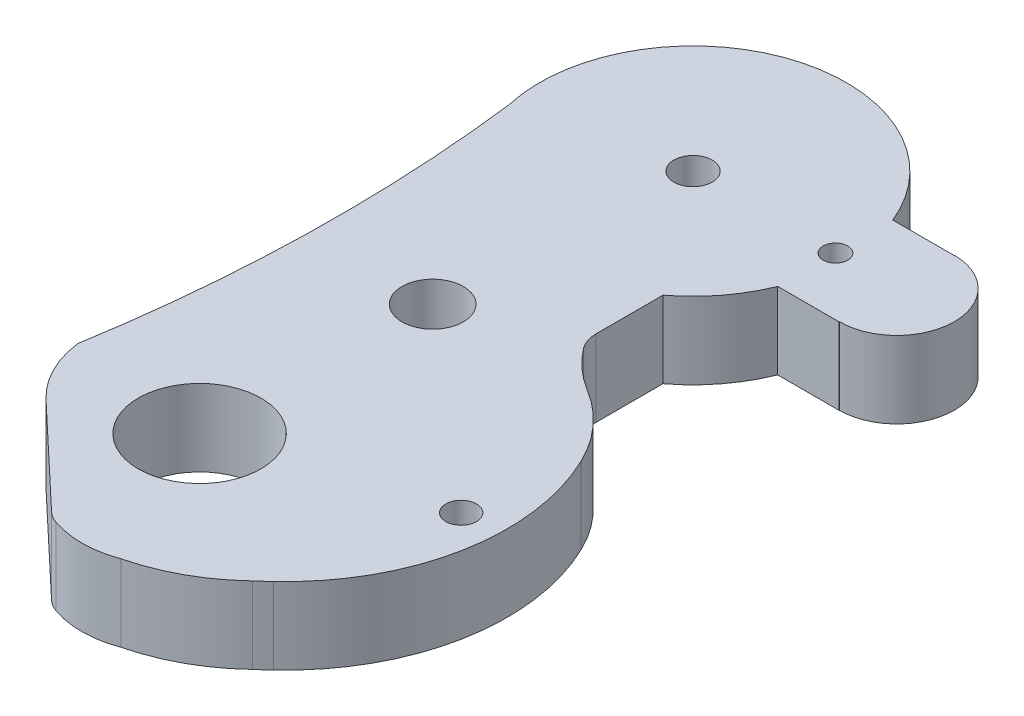
ISO-10303-21;
HEADER;
FILE_DESCRIPTION(('STEP AP214'),'2;1');
FILE_NAME('part.step','',(''),(''),'','','');
FILE_SCHEMA(('AUTOMOTIVE_DESIGN { 1 0 10303 214 1 1 1 1 }'));
ENDSEC;
DATA;
#1=APPLICATION_CONTEXT('core data for automotive mechanical design processes');
#2=APPLICATION_PROTOCOL_DEFINITION('international standard','automotive_design',2000,#1);
#3=PRODUCT_CONTEXT('',#1,'mechanical');
#4=PRODUCT('Part','Part','',(#3));
#5=PRODUCT_RELATED_PRODUCT_CATEGORY('part','',(#4));
#6=PRODUCT_DEFINITION_FORMATION('','',#4);
#7=PRODUCT_DEFINITION_CONTEXT('part definition',#1,'design');
#8=PRODUCT_DEFINITION('design','',#6,#7);
#9=PRODUCT_DEFINITION_SHAPE('','',#8);
#10=(LENGTH_UNIT() NAMED_UNIT(*) SI_UNIT(.MILLI.,.METRE.));
#11=(NAMED_UNIT(*) PLANE_ANGLE_UNIT() SI_UNIT($,.RADIAN.));
#12=(NAMED_UNIT(*) SI_UNIT($,.STERADIAN.) SOLID_ANGLE_UNIT());
#13=UNCERTAINTY_MEASURE_WITH_UNIT(LENGTH_MEASURE(1.E-05),#10,'distance_accuracy_value','');
#14=(GEOMETRIC_REPRESENTATION_CONTEXT(3) GLOBAL_UNCERTAINTY_ASSIGNED_CONTEXT((#13)) GLOBAL_UNIT_ASSIGNED_CONTEXT((#10,
#11,#12)) REPRESENTATION_CONTEXT('',''));
#15=CARTESIAN_POINT('',(0.,0.,0.));
#16=DIRECTION('',(0.,0.,1.));
#17=DIRECTION('',(1.,0.,0.));
#18=AXIS2_PLACEMENT_3D('',#15,#16,#17);
#19=CARTESIAN_POINT('',(0.974607404962177,5.,-16.));
#20=DIRECTION('',(0.,1.,0.));
#21=DIRECTION('',(0.,0.,1.));
#22=AXIS2_PLACEMENT_3D('',#19,#20,#21);
#23=PLANE('',#22);
#24=CARTESIAN_POINT('',(10.2454478315697,5.,-16.015232537957));
#25=DIRECTION('',(0.,1.,0.));
#26=DIRECTION('',(0.,0.,1.));
#27=AXIS2_PLACEMENT_3D('',#24,#25,#26);
#28=CIRCLE('',#27,0.801632386652614);
#29=CARTESIAN_POINT('',(10.2454478315697,5.,-15.2136001513043));
#30=VERTEX_POINT('',#29);
#31=EDGE_CURVE('E409',#30,#30,#28,.T.);
#32=ORIENTED_EDGE('',*,*,#31,.F.);
#33=EDGE_LOOP('',(#32));
#34=FACE_BOUND('',#33,.T.);
#35=CARTESIAN_POINT('',(0.974607404962177,5.,-16.));
#36=DIRECTION('',(0.,1.,0.));
#37=DIRECTION('',(0.,0.,1.));
#38=AXIS2_PLACEMENT_3D('',#35,#36,#37);
#39=CIRCLE('',#38,1.25);
#40=CARTESIAN_POINT('',(0.974607404962177,5.,-14.75));
#41=VERTEX_POINT('',#40);
#42=EDGE_CURVE('E393',#41,#41,#39,.T.);
#43=ORIENTED_EDGE('',*,*,#42,.F.);
#44=EDGE_LOOP('',(#43));
#45=FACE_BOUND('',#44,.T.);
#46=DIRECTION('',(0.727058949625669,0.,0.686575038702413));
#47=VECTOR('',#46,1.);
#48=CARTESIAN_POINT('',(-7.21726233960275,5.,17.9902605030518));
#49=LINE('',#48,#47);
#50=CARTESIAN_POINT('',(-7.21726233960275,5.,17.9902605030518));
#51=VERTEX_POINT('',#50);
#52=CARTESIAN_POINT('',(-0.695462039847712,5.,24.1489155825596));
#53=VERTEX_POINT('',#52);
#54=EDGE_CURVE('E338',#51,#53,#49,.T.);
#55=ORIENTED_EDGE('',*,*,#54,.T.);
#56=CARTESIAN_POINT('',(0.677688037557113,5.,22.6947976833082));
#57=DIRECTION('',(0.,1.,0.));
#58=DIRECTION('',(0.,0.,1.));
#59=AXIS2_PLACEMENT_3D('',#56,#57,#58);
#60=CIRCLE('',#59,2.);
#61=CARTESIAN_POINT('',(0.0198009511940371,5.,24.5834968604131));
#62=VERTEX_POINT('',#61);
#63=EDGE_CURVE('E11',#53,#62,#60,.T.);
#64=ORIENTED_EDGE('',*,*,#63,.T.);
#65=CARTESIAN_POINT('',(2.04817996234208,5.,18.7603125349833));
#66=DIRECTION('',(0.,1.,0.));
#67=DIRECTION('',(0.,0.,1.));
#68=AXIS2_PLACEMENT_3D('',#65,#66,#67);
#69=CIRCLE('',#68,6.16634390062681);
#70=CARTESIAN_POINT('',(4.21713136680598,5.,24.5326125017099));
#71=VERTEX_POINT('',#70);
#72=EDGE_CURVE('E248',#62,#71,#69,.T.);
#73=ORIENTED_EDGE('',*,*,#72,.T.);
#74=CARTESIAN_POINT('',(1.28281003382921,5.,12.6259004719606));
#75=DIRECTION('',(0.,1.,0.));
#76=DIRECTION('',(0.,0.,-1.));
#77=AXIS2_PLACEMENT_3D('',#74,#75,#76);
#78=CIRCLE('',#77,12.2629536835356);
#79=CARTESIAN_POINT('',(9.75886106909215,5.,21.4879878046468));
#80=VERTEX_POINT('',#79);
#81=EDGE_CURVE('E380',#71,#80,#78,.T.);
#82=ORIENTED_EDGE('',*,*,#81,.T.);
#83=CARTESIAN_POINT('',(1.43522280426066,5.,11.6928102282221));
#84=DIRECTION('',(0.,1.,0.));
#85=DIRECTION('',(0.,0.,-1.));
#86=AXIS2_PLACEMENT_3D('',#83,#84,#85);
#87=CIRCLE('',#86,12.8541222071933);
#88=CARTESIAN_POINT('',(10.471403603469,5.,20.8347954765956));
#89=VERTEX_POINT('',#88);
#90=EDGE_CURVE('E377',#80,#89,#87,.T.);
#91=ORIENTED_EDGE('',*,*,#90,.T.);
#92=CARTESIAN_POINT('',(0.731361604442221,5.,10.2463105660363));
#93=DIRECTION('',(0.,1.,0.));
#94=DIRECTION('',(0.,0.,-1.));
#95=AXIS2_PLACEMENT_3D('',#92,#93,#94);
#96=CIRCLE('',#95,14.3869534941886);
#97=CARTESIAN_POINT('',(13.6971581945239,5.,4.01152511434899));
#98=VERTEX_POINT('',#97);
#99=EDGE_CURVE('E373',#89,#98,#96,.T.);
#100=ORIENTED_EDGE('',*,*,#99,.T.);
#101=CARTESIAN_POINT('',(4.68496767391163,5.,8.34516354183524));
#102=DIRECTION('',(0.,1.,0.));
#103=DIRECTION('',(0.,0.,1.));
#104=AXIS2_PLACEMENT_3D('',#101,#102,#103);
#105=CIRCLE('',#104,10.);
#106=CARTESIAN_POINT('',(9.87941642371002,5.,-0.199876082749191));
#107=VERTEX_POINT('',#106);
#108=EDGE_CURVE('E219',#98,#107,#105,.T.);
#109=ORIENTED_EDGE('',*,*,#108,.T.);
#110=CARTESIAN_POINT('',(14.4947138463816,5.,-7.79219266061537));
#111=DIRECTION('',(0.,-1.,0.));
#112=DIRECTION('',(0.,0.,1.));
#113=AXIS2_PLACEMENT_3D('',#110,#111,#112);
#114=CIRCLE('',#113,8.88505719273996);
#115=CARTESIAN_POINT('',(7.40438640935661,5.,-2.43761535199134));
#116=VERTEX_POINT('',#115);
#117=EDGE_CURVE('E369',#107,#116,#114,.T.);
#118=ORIENTED_EDGE('',*,*,#117,.T.);
#119=CARTESIAN_POINT('',(9.00039806875673,5.,-3.64291480982698));
#120=DIRECTION('',(0.,1.,0.));
#121=DIRECTION('',(0.,0.,1.));
#122=AXIS2_PLACEMENT_3D('',#119,#120,#121);
#123=CIRCLE('',#122,2.);
#124=CARTESIAN_POINT('',(7.00039806875673,5.,-3.64291480982698));
#125=VERTEX_POINT('',#124);
#126=EDGE_CURVE('E232',#116,#125,#123,.F.);
#127=ORIENTED_EDGE('',*,*,#126,.T.);
#128=DIRECTION('',(0.,0.,-1.));
#129=VECTOR('',#128,1.);
#130=CARTESIAN_POINT('',(7.00039806875673,5.,-8.01940811241883));
#131=LINE('',#130,#129);
#132=CARTESIAN_POINT('',(7.00039806875673,5.,-8.01940811241883));
#133=VERTEX_POINT('',#132);
#134=EDGE_CURVE('E366',#125,#133,#131,.T.);
#135=ORIENTED_EDGE('',*,*,#134,.T.);
#136=CARTESIAN_POINT('',(0.974607404962177,5.,-16.));
#137=DIRECTION('',(0.,1.,0.));
#138=DIRECTION('',(0.,0.,1.));
#139=AXIS2_PLACEMENT_3D('',#136,#137,#138);
#140=CIRCLE('',#139,10.);
#141=CARTESIAN_POINT('',(10.2454478315697,5.,-12.2514645814158));
#142=VERTEX_POINT('',#141);
#143=EDGE_CURVE('E363',#133,#142,#140,.T.);
#144=ORIENTED_EDGE('',*,*,#143,.T.);
#145=DIRECTION('',(1.,0.,0.));
#146=VECTOR('',#145,1.);
#147=CARTESIAN_POINT('',(10.2454478315697,5.,-12.2514645814158));
#148=LINE('',#147,#146);
#149=CARTESIAN_POINT('',(14.2454478315697,5.,-12.2514645814158));
#150=VERTEX_POINT('',#149);
#151=EDGE_CURVE('E360',#142,#150,#148,.T.);
#152=ORIENTED_EDGE('',*,*,#151,.T.);
#153=DIRECTION('',(0.,0.,-1.));
#154=VECTOR('',#153,1.);
#155=CARTESIAN_POINT('',(14.2454478315697,5.,-12.2514645814158));
#156=LINE('',#155,#154);
#157=CARTESIAN_POINT('',(14.2454478315697,5.,-12.265232537957));
#158=VERTEX_POINT('',#157);
#159=EDGE_CURVE('E357',#150,#158,#156,.T.);
#160=ORIENTED_EDGE('',*,*,#159,.T.);
#161=CARTESIAN_POINT('',(14.2454478315697,5.,-16.015232537957));
#162=DIRECTION('',(0.,1.,0.));
#163=DIRECTION('',(0.,0.,1.));
#164=AXIS2_PLACEMENT_3D('',#161,#162,#163);
#165=CIRCLE('',#164,3.75);
#166=CARTESIAN_POINT('',(14.2454478315697,5.,-19.765232537957));
#167=VERTEX_POINT('',#166);
#168=EDGE_CURVE('E354',#158,#167,#165,.T.);
#169=ORIENTED_EDGE('',*,*,#168,.T.);
#170=DIRECTION('',(-1.03893578122433E-13,0.,1.));
#171=VECTOR('',#170,1.);
#172=CARTESIAN_POINT('',(14.2454478315697,5.,-19.765232537957));
#173=LINE('',#172,#171);
#174=CARTESIAN_POINT('',(14.2454478315697,5.,-19.7485354185842));
#175=VERTEX_POINT('',#174);
#176=EDGE_CURVE('E351',#167,#175,#173,.T.);
#177=ORIENTED_EDGE('',*,*,#176,.T.);
#178=DIRECTION('',(-1.,0.,0.));
#179=VECTOR('',#178,1.);
#180=CARTESIAN_POINT('',(10.2454478315697,5.,-19.7485354185842));
#181=LINE('',#180,#179);
#182=CARTESIAN_POINT('',(10.2454478315697,5.,-19.7485354185842));
#183=VERTEX_POINT('',#182);
#184=EDGE_CURVE('E192',#175,#183,#181,.T.);
#185=ORIENTED_EDGE('',*,*,#184,.T.);
#186=CARTESIAN_POINT('',(0.974607404962177,5.,-16.));
#187=DIRECTION('',(0.,1.,0.));
#188=DIRECTION('',(0.,0.,1.));
#189=AXIS2_PLACEMENT_3D('',#186,#187,#188);
#190=CIRCLE('',#189,10.);
#191=CARTESIAN_POINT('',(-8.77146664465953,5.,-13.7607946455739));
#192=VERTEX_POINT('',#191);
#193=EDGE_CURVE('E187',#183,#192,#190,.T.);
#194=ORIENTED_EDGE('',*,*,#193,.T.);
#195=CARTESIAN_POINT('',(-104.432630634702,5.,-1.96176281245479));
#196=DIRECTION('',(0.,-1.,0.));
#197=DIRECTION('',(0.,0.,-1.));
#198=AXIS2_PLACEMENT_3D('',#195,#196,#197);
#199=CIRCLE('',#198,96.3860749700326);
#200=CARTESIAN_POINT('',(-9.34331307153592,5.,13.79568410956));
#201=VERTEX_POINT('',#200);
#202=EDGE_CURVE('E175',#192,#201,#199,.T.);
#203=ORIENTED_EDGE('',*,*,#202,.T.);
#204=CARTESIAN_POINT('',(-2.44267041005947,5.,12.9341346646501));
#205=DIRECTION('',(0.,1.,0.));
#206=DIRECTION('',(0.,0.,1.));
#207=AXIS2_PLACEMENT_3D('',#204,#205,#206);
#208=CIRCLE('',#207,6.95421718005797);
#209=EDGE_CURVE('E186',#201,#51,#208,.T.);
#210=ORIENTED_EDGE('',*,*,#209,.T.);
#211=EDGE_LOOP('',(#55,#64,#73,#82,#91,#100,#109,#118,#127,#135,#144,#152,#160,#169,#177,#185,
#194,#203,#210));
#212=FACE_BOUND('',#211,.T.);
#213=CARTESIAN_POINT('',(0.,5.,0.));
#214=DIRECTION('',(0.,1.,0.));
#215=DIRECTION('',(0.,0.,1.));
#216=AXIS2_PLACEMENT_3D('',#213,#214,#215);
#217=CIRCLE('',#216,2.);
#218=CARTESIAN_POINT('',(0.,5.,2.));
#219=VERTEX_POINT('',#218);
#220=EDGE_CURVE('E348',#219,#219,#217,.T.);
#221=ORIENTED_EDGE('',*,*,#220,.F.);
#222=EDGE_LOOP('',(#221));
#223=FACE_BOUND('',#222,.T.);
#224=CARTESIAN_POINT('',(-0.296635988770262,5.,14.8977042577984));
#225=DIRECTION('',(0.,1.,0.));
#226=DIRECTION('',(0.,0.,1.));
#227=AXIS2_PLACEMENT_3D('',#224,#225,#226);
#228=CIRCLE('',#227,4.);
#229=CARTESIAN_POINT('',(-0.296635988770262,5.,18.8977042577984));
#230=VERTEX_POINT('',#229);
#231=EDGE_CURVE('E401',#230,#230,#228,.T.);
#232=ORIENTED_EDGE('',*,*,#231,.F.);
#233=EDGE_LOOP('',(#232));
#234=FACE_BOUND('',#233,.T.);
#235=CARTESIAN_POINT('',(12.7069755294834,5.,10.8462503022307));
#236=DIRECTION('',(0.,1.,0.));
#237=DIRECTION('',(0.,0.,1.));
#238=AXIS2_PLACEMENT_3D('',#235,#236,#237);
#239=CIRCLE('',#238,1.);
#240=CARTESIAN_POINT('',(12.7069755294834,5.,11.8462503022307));
#241=VERTEX_POINT('',#240);
#242=EDGE_CURVE('E417',#241,#241,#239,.T.);
#243=ORIENTED_EDGE('',*,*,#242,.F.);
#244=EDGE_LOOP('',(#243));
#245=FACE_BOUND('',#244,.T.);
#246=ADVANCED_FACE('F43',(#34,#45,#212,#223,#234,#245),#23,.T.);
#247=CARTESIAN_POINT('',(0.974607404962177,0.,-16.));
#248=DIRECTION('',(0.,1.,0.));
#249=DIRECTION('',(0.,0.,1.));
#250=AXIS2_PLACEMENT_3D('',#247,#248,#249);
#251=PLANE('',#250);
#252=CARTESIAN_POINT('',(2.04817996234208,0.,18.7603125349833));
#253=DIRECTION('',(0.,1.,0.));
#254=DIRECTION('',(0.,0.,1.));
#255=AXIS2_PLACEMENT_3D('',#252,#253,#254);
#256=CIRCLE('',#255,6.16634390062681);
#257=CARTESIAN_POINT('',(0.0198009511940371,0.,24.5834968604131));
#258=VERTEX_POINT('',#257);
#259=CARTESIAN_POINT('',(4.21713136680598,0.,24.5326125017099));
#260=VERTEX_POINT('',#259);
#261=EDGE_CURVE('E246',#258,#260,#256,.T.);
#262=ORIENTED_EDGE('',*,*,#261,.F.);
#263=CARTESIAN_POINT('',(0.677688037557113,0.,22.6947976833082));
#264=DIRECTION('',(0.,1.,0.));
#265=DIRECTION('',(0.,0.,1.));
#266=AXIS2_PLACEMENT_3D('',#263,#264,#265);
#267=CIRCLE('',#266,2.);
#268=CARTESIAN_POINT('',(-0.695462039847712,0.,24.1489155825596));
#269=VERTEX_POINT('',#268);
#270=EDGE_CURVE('E66',#258,#269,#267,.F.);
#271=ORIENTED_EDGE('',*,*,#270,.T.);
#272=DIRECTION('',(0.727058949625669,0.,0.686575038702413));
#273=VECTOR('',#272,1.);
#274=CARTESIAN_POINT('',(-7.21726233960275,0.,17.9902605030518));
#275=LINE('',#274,#273);
#276=CARTESIAN_POINT('',(-7.21726233960275,0.,17.9902605030518));
#277=VERTEX_POINT('',#276);
#278=EDGE_CURVE('E257',#277,#269,#275,.T.);
#279=ORIENTED_EDGE('',*,*,#278,.F.);
#280=CARTESIAN_POINT('',(-2.44267041005947,0.,12.9341346646501));
#281=DIRECTION('',(0.,1.,0.));
#282=DIRECTION('',(0.,0.,1.));
#283=AXIS2_PLACEMENT_3D('',#280,#281,#282);
#284=CIRCLE('',#283,6.95421718005797);
#285=CARTESIAN_POINT('',(-9.34331307153592,0.,13.79568410956));
#286=VERTEX_POINT('',#285);
#287=EDGE_CURVE('E263',#286,#277,#284,.T.);
#288=ORIENTED_EDGE('',*,*,#287,.F.);
#289=CARTESIAN_POINT('',(-104.432630634702,0.,-1.96176281245479));
#290=DIRECTION('',(0.,-1.,0.));
#291=DIRECTION('',(0.,0.,-1.));
#292=AXIS2_PLACEMENT_3D('',#289,#290,#291);
#293=CIRCLE('',#292,96.3860749700326);
#294=CARTESIAN_POINT('',(-8.77146664465953,0.,-13.7607946455739));
#295=VERTEX_POINT('',#294);
#296=EDGE_CURVE('E341',#295,#286,#293,.T.);
#297=ORIENTED_EDGE('',*,*,#296,.F.);
#298=CARTESIAN_POINT('',(0.974607404962177,0.,-16.));
#299=DIRECTION('',(0.,1.,0.));
#300=DIRECTION('',(0.,0.,1.));
#301=AXIS2_PLACEMENT_3D('',#298,#299,#300);
#302=CIRCLE('',#301,10.);
#303=CARTESIAN_POINT('',(10.2454478315697,0.,-19.7485354185842));
#304=VERTEX_POINT('',#303);
#305=EDGE_CURVE('E201',#304,#295,#302,.T.);
#306=ORIENTED_EDGE('',*,*,#305,.F.);
#307=DIRECTION('',(-1.,0.,0.));
#308=VECTOR('',#307,1.);
#309=CARTESIAN_POINT('',(10.2454478315697,0.,-19.7485354185842));
#310=LINE('',#309,#308);
#311=CARTESIAN_POINT('',(14.2454478315697,0.,-19.7485354185842));
#312=VERTEX_POINT('',#311);
#313=EDGE_CURVE('E197',#312,#304,#310,.T.);
#314=ORIENTED_EDGE('',*,*,#313,.F.);
#315=DIRECTION('',(-1.03893578122433E-13,0.,1.));
#316=VECTOR('',#315,1.);
#317=CARTESIAN_POINT('',(14.2454478315697,0.,-19.765232537957));
#318=LINE('',#317,#316);
#319=CARTESIAN_POINT('',(14.2454478315697,0.,-19.765232537957));
#320=VERTEX_POINT('',#319);
#321=EDGE_CURVE('E292',#320,#312,#318,.T.);
#322=ORIENTED_EDGE('',*,*,#321,.F.);
#323=CARTESIAN_POINT('',(14.2454478315697,0.,-16.015232537957));
#324=DIRECTION('',(0.,1.,0.));
#325=DIRECTION('',(0.,0.,1.));
#326=AXIS2_PLACEMENT_3D('',#323,#324,#325);
#327=CIRCLE('',#326,3.75);
#328=CARTESIAN_POINT('',(14.2454478315697,0.,-12.265232537957));
#329=VERTEX_POINT('',#328);
#330=EDGE_CURVE('E289',#329,#320,#327,.T.);
#331=ORIENTED_EDGE('',*,*,#330,.F.);
#332=DIRECTION('',(0.,0.,-1.));
#333=VECTOR('',#332,1.);
#334=CARTESIAN_POINT('',(14.2454478315697,0.,-12.2514645814158));
#335=LINE('',#334,#333);
#336=CARTESIAN_POINT('',(14.2454478315697,0.,-12.2514645814158));
#337=VERTEX_POINT('',#336);
#338=EDGE_CURVE('E286',#337,#329,#335,.T.);
#339=ORIENTED_EDGE('',*,*,#338,.F.);
#340=DIRECTION('',(1.,0.,0.));
#341=VECTOR('',#340,1.);
#342=CARTESIAN_POINT('',(10.2454478315697,0.,-12.2514645814158));
#343=LINE('',#342,#341);
#344=CARTESIAN_POINT('',(10.2454478315697,0.,-12.2514645814158));
#345=VERTEX_POINT('',#344);
#346=EDGE_CURVE('E283',#345,#337,#343,.T.);
#347=ORIENTED_EDGE('',*,*,#346,.F.);
#348=CARTESIAN_POINT('',(0.974607404962177,0.,-16.));
#349=DIRECTION('',(0.,1.,0.));
#350=DIRECTION('',(0.,0.,1.));
#351=AXIS2_PLACEMENT_3D('',#348,#349,#350);
#352=CIRCLE('',#351,10.);
#353=CARTESIAN_POINT('',(7.00039806875673,0.,-8.01940811241883));
#354=VERTEX_POINT('',#353);
#355=EDGE_CURVE('E280',#354,#345,#352,.T.);
#356=ORIENTED_EDGE('',*,*,#355,.F.);
#357=DIRECTION('',(0.,0.,-1.));
#358=VECTOR('',#357,1.);
#359=CARTESIAN_POINT('',(7.00039806875673,0.,-8.01940811241883));
#360=LINE('',#359,#358);
#361=CARTESIAN_POINT('',(7.00039806875673,0.,-3.64291480982698));
#362=VERTEX_POINT('',#361);
#363=EDGE_CURVE('E277',#362,#354,#360,.T.);
#364=ORIENTED_EDGE('',*,*,#363,.F.);
#365=CARTESIAN_POINT('',(9.00039806875673,0.,-3.64291480982698));
#366=DIRECTION('',(0.,1.,0.));
#367=DIRECTION('',(0.,0.,1.));
#368=AXIS2_PLACEMENT_3D('',#365,#366,#367);
#369=CIRCLE('',#368,2.);
#370=CARTESIAN_POINT('',(7.40438640935661,0.,-2.43761535199134));
#371=VERTEX_POINT('',#370);
#372=EDGE_CURVE('E229',#362,#371,#369,.T.);
#373=ORIENTED_EDGE('',*,*,#372,.T.);
#374=CARTESIAN_POINT('',(14.4947138463816,0.,-7.79219266061537));
#375=DIRECTION('',(0.,-1.,0.));
#376=DIRECTION('',(0.,0.,1.));
#377=AXIS2_PLACEMENT_3D('',#374,#375,#376);
#378=CIRCLE('',#377,8.88505719273996);
#379=CARTESIAN_POINT('',(9.87941642371002,0.,-0.199876082749191));
#380=VERTEX_POINT('',#379);
#381=EDGE_CURVE('E273',#380,#371,#378,.T.);
#382=ORIENTED_EDGE('',*,*,#381,.F.);
#383=CARTESIAN_POINT('',(4.68496767391163,0.,8.34516354183524));
#384=DIRECTION('',(0.,1.,0.));
#385=DIRECTION('',(0.,0.,1.));
#386=AXIS2_PLACEMENT_3D('',#383,#384,#385);
#387=CIRCLE('',#386,10.);
#388=CARTESIAN_POINT('',(13.6971581945239,0.,4.01152511434899));
#389=VERTEX_POINT('',#388);
#390=EDGE_CURVE('E208',#380,#389,#387,.F.);
#391=ORIENTED_EDGE('',*,*,#390,.T.);
#392=CARTESIAN_POINT('',(0.731361604442221,0.,10.2463105660363));
#393=DIRECTION('',(0.,1.,0.));
#394=DIRECTION('',(0.,0.,-1.));
#395=AXIS2_PLACEMENT_3D('',#392,#393,#394);
#396=CIRCLE('',#395,14.3869534941886);
#397=CARTESIAN_POINT('',(10.471403603469,0.,20.8347954765956));
#398=VERTEX_POINT('',#397);
#399=EDGE_CURVE('E269',#398,#389,#396,.T.);
#400=ORIENTED_EDGE('',*,*,#399,.F.);
#401=CARTESIAN_POINT('',(1.43522280426066,0.,11.6928102282221));
#402=DIRECTION('',(0.,1.,0.));
#403=DIRECTION('',(0.,0.,-1.));
#404=AXIS2_PLACEMENT_3D('',#401,#402,#403);
#405=CIRCLE('',#404,12.8541222071933);
#406=CARTESIAN_POINT('',(9.75886106909215,0.,21.4879878046468));
#407=VERTEX_POINT('',#406);
#408=EDGE_CURVE('E261',#407,#398,#405,.T.);
#409=ORIENTED_EDGE('',*,*,#408,.F.);
#410=CARTESIAN_POINT('',(1.28281003382921,0.,12.6259004719606));
#411=DIRECTION('',(0.,1.,0.));
#412=DIRECTION('',(0.,0.,-1.));
#413=AXIS2_PLACEMENT_3D('',#410,#411,#412);
#414=CIRCLE('',#413,12.2629536835356);
#415=EDGE_CURVE('E255',#260,#407,#414,.T.);
#416=ORIENTED_EDGE('',*,*,#415,.F.);
#417=EDGE_LOOP('',(#262,#271,#279,#288,#297,#306,#314,#322,#331,#339,#347,#356,#364,#373,#382,
#391,#400,#409,#416));
#418=FACE_BOUND('',#417,.T.);
#419=CARTESIAN_POINT('',(0.,0.,0.));
#420=DIRECTION('',(0.,1.,0.));
#421=DIRECTION('',(0.,0.,1.));
#422=AXIS2_PLACEMENT_3D('',#419,#420,#421);
#423=CIRCLE('',#422,2.);
#424=CARTESIAN_POINT('',(0.,0.,2.));
#425=VERTEX_POINT('',#424);
#426=EDGE_CURVE('E389',#425,#425,#423,.T.);
#427=ORIENTED_EDGE('',*,*,#426,.T.);
#428=EDGE_LOOP('',(#427));
#429=FACE_BOUND('',#428,.T.);
#430=CARTESIAN_POINT('',(0.974607404962177,0.,-16.));
#431=DIRECTION('',(0.,1.,0.));
#432=DIRECTION('',(0.,0.,1.));
#433=AXIS2_PLACEMENT_3D('',#430,#431,#432);
#434=CIRCLE('',#433,1.25);
#435=CARTESIAN_POINT('',(0.974607404962177,0.,-14.75));
#436=VERTEX_POINT('',#435);
#437=EDGE_CURVE('E397',#436,#436,#434,.T.);
#438=ORIENTED_EDGE('',*,*,#437,.T.);
#439=EDGE_LOOP('',(#438));
#440=FACE_BOUND('',#439,.T.);
#441=CARTESIAN_POINT('',(-0.296635988770262,0.,14.8977042577984));
#442=DIRECTION('',(0.,1.,0.));
#443=DIRECTION('',(0.,0.,1.));
#444=AXIS2_PLACEMENT_3D('',#441,#442,#443);
#445=CIRCLE('',#444,4.);
#446=CARTESIAN_POINT('',(-0.296635988770262,0.,18.8977042577984));
#447=VERTEX_POINT('',#446);
#448=EDGE_CURVE('E405',#447,#447,#445,.T.);
#449=ORIENTED_EDGE('',*,*,#448,.T.);
#450=EDGE_LOOP('',(#449));
#451=FACE_BOUND('',#450,.T.);
#452=CARTESIAN_POINT('',(10.2454478315697,0.,-16.015232537957));
#453=DIRECTION('',(0.,1.,0.));
#454=DIRECTION('',(0.,0.,1.));
#455=AXIS2_PLACEMENT_3D('',#452,#453,#454);
#456=CIRCLE('',#455,0.801632386652614);
#457=CARTESIAN_POINT('',(10.2454478315697,0.,-15.2136001513043));
#458=VERTEX_POINT('',#457);
#459=EDGE_CURVE('E413',#458,#458,#456,.T.);
#460=ORIENTED_EDGE('',*,*,#459,.T.);
#461=EDGE_LOOP('',(#460));
#462=FACE_BOUND('',#461,.T.);
#463=CARTESIAN_POINT('',(12.7069755294834,0.,10.8462503022307));
#464=DIRECTION('',(0.,1.,0.));
#465=DIRECTION('',(0.,0.,1.));
#466=AXIS2_PLACEMENT_3D('',#463,#464,#465);
#467=CIRCLE('',#466,1.);
#468=CARTESIAN_POINT('',(12.7069755294834,0.,11.8462503022307));
#469=VERTEX_POINT('',#468);
#470=EDGE_CURVE('E421',#469,#469,#467,.T.);
#471=ORIENTED_EDGE('',*,*,#470,.T.);
#472=EDGE_LOOP('',(#471));
#473=FACE_BOUND('',#472,.T.);
#474=ADVANCED_FACE('F252',(#418,#429,#440,#451,#462,#473),#251,.F.);
#475=CARTESIAN_POINT('',(0.974607404962177,5.,-16.));
#476=DIRECTION('',(0.,-1.,0.));
#477=DIRECTION('',(0.,0.,-1.));
#478=AXIS2_PLACEMENT_3D('',#475,#476,#477);
#479=CYLINDRICAL_SURFACE('',#478,10.);
#480=ORIENTED_EDGE('',*,*,#305,.T.);
#481=DIRECTION('',(0.,-1.,0.));
#482=VECTOR('',#481,1.);
#483=CARTESIAN_POINT('',(-8.77146664465953,5.,-13.7607946455739));
#484=LINE('',#483,#482);
#485=EDGE_CURVE('E179',#192,#295,#484,.T.);
#486=ORIENTED_EDGE('',*,*,#485,.F.);
#487=ORIENTED_EDGE('',*,*,#193,.F.);
#488=DIRECTION('',(0.,-1.,0.));
#489=VECTOR('',#488,1.);
#490=CARTESIAN_POINT('',(10.2454478315697,5.,-19.7485354185842));
#491=LINE('',#490,#489);
#492=EDGE_CURVE('E297',#183,#304,#491,.T.);
#493=ORIENTED_EDGE('',*,*,#492,.T.);
#494=EDGE_LOOP('',(#480,#486,#487,#493));
#495=FACE_BOUND('',#494,.T.);
#496=ADVANCED_FACE('F199',(#495),#479,.T.);
#497=CARTESIAN_POINT('',(-104.432630634702,5.,-1.96176281245479));
#498=DIRECTION('',(0.,-1.,0.));
#499=DIRECTION('',(0.,0.,-1.));
#500=AXIS2_PLACEMENT_3D('',#497,#498,#499);
#501=CYLINDRICAL_SURFACE('',#500,96.3860749700326);
#502=ORIENTED_EDGE('',*,*,#296,.T.);
#503=DIRECTION('',(0.,-1.,0.));
#504=VECTOR('',#503,1.);
#505=CARTESIAN_POINT('',(-9.34331307153592,5.,13.79568410956));
#506=LINE('',#505,#504);
#507=EDGE_CURVE('E182',#201,#286,#506,.T.);
#508=ORIENTED_EDGE('',*,*,#507,.F.);
#509=ORIENTED_EDGE('',*,*,#202,.F.);
#510=ORIENTED_EDGE('',*,*,#485,.T.);
#511=EDGE_LOOP('',(#502,#508,#509,#510));
#512=FACE_BOUND('',#511,.T.);
#513=ADVANCED_FACE('F177',(#512),#501,.F.);
#514=CARTESIAN_POINT('',(-2.44267041005947,5.,12.9341346646501));
#515=DIRECTION('',(0.,-1.,0.));
#516=DIRECTION('',(0.,0.,-1.));
#517=AXIS2_PLACEMENT_3D('',#514,#515,#516);
#518=CYLINDRICAL_SURFACE('',#517,6.95421718005797);
#519=ORIENTED_EDGE('',*,*,#287,.T.);
#520=DIRECTION('',(0.,-1.,0.));
#521=VECTOR('',#520,1.);
#522=CARTESIAN_POINT('',(-7.21726233960275,5.,17.9902605030518));
#523=LINE('',#522,#521);
#524=EDGE_CURVE('E210',#51,#277,#523,.T.);
#525=ORIENTED_EDGE('',*,*,#524,.F.);
#526=ORIENTED_EDGE('',*,*,#209,.F.);
#527=ORIENTED_EDGE('',*,*,#507,.T.);
#528=EDGE_LOOP('',(#519,#525,#526,#527));
#529=FACE_BOUND('',#528,.T.);
#530=ADVANCED_FACE('F493',(#529),#518,.T.);
#531=CARTESIAN_POINT('',(-7.21726233960275,5.,17.9902605030518));
#532=DIRECTION('',(0.686575038702413,0.,-0.727058949625669));
#533=DIRECTION('',(-0.727058949625669,0.,-0.686575038702413));
#534=AXIS2_PLACEMENT_3D('',#531,#532,#533);
#535=PLANE('',#534);
#536=ORIENTED_EDGE('',*,*,#278,.T.);
#537=DIRECTION('',(0.,-1.,0.));
#538=VECTOR('',#537,1.);
#539=CARTESIAN_POINT('',(-0.695462039847712,5.,24.1489155825596));
#540=LINE('',#539,#538);
#541=EDGE_CURVE('E52',#269,#53,#540,.F.);
#542=ORIENTED_EDGE('',*,*,#541,.T.);
#543=ORIENTED_EDGE('',*,*,#54,.F.);
#544=ORIENTED_EDGE('',*,*,#524,.T.);
#545=EDGE_LOOP('',(#536,#542,#543,#544));
#546=FACE_BOUND('',#545,.T.);
#547=ADVANCED_FACE('F337',(#546),#535,.F.);
#548=CARTESIAN_POINT('',(2.04817996234208,5.,18.7603125349833));
#549=DIRECTION('',(0.,-1.,0.));
#550=DIRECTION('',(0.,0.,-1.));
#551=AXIS2_PLACEMENT_3D('',#548,#549,#550);
#552=CYLINDRICAL_SURFACE('',#551,6.16634390062681);
#553=ORIENTED_EDGE('',*,*,#72,.F.);
#554=DIRECTION('',(0.,-1.,0.));
#555=VECTOR('',#554,1.);
#556=CARTESIAN_POINT('',(0.0198009511940375,5.,24.5834968604131));
#557=LINE('',#556,#555);
#558=EDGE_CURVE('E235',#62,#258,#557,.T.);
#559=ORIENTED_EDGE('',*,*,#558,.T.);
#560=ORIENTED_EDGE('',*,*,#261,.T.);
#561=DIRECTION('',(0.,-1.,0.));
#562=VECTOR('',#561,1.);
#563=CARTESIAN_POINT('',(4.21713136680598,5.,24.5326125017099));
#564=LINE('',#563,#562);
#565=EDGE_CURVE('E332',#71,#260,#564,.T.);
#566=ORIENTED_EDGE('',*,*,#565,.F.);
#567=EDGE_LOOP('',(#553,#559,#560,#566));
#568=FACE_BOUND('',#567,.T.);
#569=ADVANCED_FACE('F244',(#568),#552,.T.);
#570=CARTESIAN_POINT('',(1.28281003382921,5.,12.6259004719606));
#571=DIRECTION('',(0.,-1.,0.));
#572=DIRECTION('',(0.,0.,-1.));
#573=AXIS2_PLACEMENT_3D('',#570,#571,#572);
#574=CYLINDRICAL_SURFACE('',#573,12.2629536835356);
#575=ORIENTED_EDGE('',*,*,#415,.T.);
#576=DIRECTION('',(0.,-1.,0.));
#577=VECTOR('',#576,1.);
#578=CARTESIAN_POINT('',(9.75886106909215,5.,21.4879878046468));
#579=LINE('',#578,#577);
#580=EDGE_CURVE('E328',#80,#407,#579,.T.);
#581=ORIENTED_EDGE('',*,*,#580,.F.);
#582=ORIENTED_EDGE('',*,*,#81,.F.);
#583=ORIENTED_EDGE('',*,*,#565,.T.);
#584=EDGE_LOOP('',(#575,#581,#582,#583));
#585=FACE_BOUND('',#584,.T.);
#586=ADVANCED_FACE('F484',(#585),#574,.T.);
#587=CARTESIAN_POINT('',(1.43522280426066,5.,11.6928102282221));
#588=DIRECTION('',(0.,-1.,0.));
#589=DIRECTION('',(0.,0.,-1.));
#590=AXIS2_PLACEMENT_3D('',#587,#588,#589);
#591=CYLINDRICAL_SURFACE('',#590,12.8541222071933);
#592=ORIENTED_EDGE('',*,*,#408,.T.);
#593=DIRECTION('',(0.,-1.,0.));
#594=VECTOR('',#593,1.);
#595=CARTESIAN_POINT('',(10.471403603469,5.,20.8347954765956));
#596=LINE('',#595,#594);
#597=EDGE_CURVE('E324',#89,#398,#596,.T.);
#598=ORIENTED_EDGE('',*,*,#597,.F.);
#599=ORIENTED_EDGE('',*,*,#90,.F.);
#600=ORIENTED_EDGE('',*,*,#580,.T.);
#601=EDGE_LOOP('',(#592,#598,#599,#600));
#602=FACE_BOUND('',#601,.T.);
#603=ADVANCED_FACE('F480',(#602),#591,.T.);
#604=CARTESIAN_POINT('',(0.731361604442221,5.,10.2463105660363));
#605=DIRECTION('',(0.,-1.,0.));
#606=DIRECTION('',(0.,0.,-1.));
#607=AXIS2_PLACEMENT_3D('',#604,#605,#606);
#608=CYLINDRICAL_SURFACE('',#607,14.3869534941886);
#609=ORIENTED_EDGE('',*,*,#399,.T.);
#610=DIRECTION('',(0.,-1.,0.));
#611=VECTOR('',#610,1.);
#612=CARTESIAN_POINT('',(13.6971581945239,5.,4.01152511434899));
#613=LINE('',#612,#611);
#614=EDGE_CURVE('E216',#389,#98,#613,.F.);
#615=ORIENTED_EDGE('',*,*,#614,.T.);
#616=ORIENTED_EDGE('',*,*,#99,.F.);
#617=ORIENTED_EDGE('',*,*,#597,.T.);
#618=EDGE_LOOP('',(#609,#615,#616,#617));
#619=FACE_BOUND('',#618,.T.);
#620=ADVANCED_FACE('F476',(#619),#608,.T.);
#621=CARTESIAN_POINT('',(14.4947138463816,5.,-7.79219266061537));
#622=DIRECTION('',(0.,-1.,0.));
#623=DIRECTION('',(0.,0.,-1.));
#624=AXIS2_PLACEMENT_3D('',#621,#622,#623);
#625=CYLINDRICAL_SURFACE('',#624,8.88505719273996);
#626=ORIENTED_EDGE('',*,*,#381,.T.);
#627=DIRECTION('',(0.,-1.,0.));
#628=VECTOR('',#627,1.);
#629=CARTESIAN_POINT('',(7.40438640935661,5.,-2.43761535199134));
#630=LINE('',#629,#628);
#631=EDGE_CURVE('E226',#371,#116,#630,.F.);
#632=ORIENTED_EDGE('',*,*,#631,.T.);
#633=ORIENTED_EDGE('',*,*,#117,.F.);
#634=DIRECTION('',(0.,-1.,0.));
#635=VECTOR('',#634,1.);
#636=CARTESIAN_POINT('',(9.87941642371002,5.,-0.199876082749189));
#637=LINE('',#636,#635);
#638=EDGE_CURVE('E203',#107,#380,#637,.T.);
#639=ORIENTED_EDGE('',*,*,#638,.T.);
#640=EDGE_LOOP('',(#626,#632,#633,#639));
#641=FACE_BOUND('',#640,.T.);
#642=ADVANCED_FACE('F472',(#641),#625,.F.);
#643=CARTESIAN_POINT('',(7.00039806875673,5.,-8.01940811241883));
#644=DIRECTION('',(-1.,0.,0.));
#645=DIRECTION('',(0.,0.,1.));
#646=AXIS2_PLACEMENT_3D('',#643,#644,#645);
#647=PLANE('',#646);
#648=ORIENTED_EDGE('',*,*,#134,.F.);
#649=DIRECTION('',(0.,1.,0.));
#650=VECTOR('',#649,1.);
#651=CARTESIAN_POINT('',(7.00039806875673,0.,-3.64291480982698));
#652=LINE('',#651,#650);
#653=EDGE_CURVE('E222',#125,#362,#652,.F.);
#654=ORIENTED_EDGE('',*,*,#653,.T.);
#655=ORIENTED_EDGE('',*,*,#363,.T.);
#656=DIRECTION('',(0.,-1.,0.));
#657=VECTOR('',#656,1.);
#658=CARTESIAN_POINT('',(7.00039806875673,5.,-8.01940811241883));
#659=LINE('',#658,#657);
#660=EDGE_CURVE('E320',#133,#354,#659,.T.);
#661=ORIENTED_EDGE('',*,*,#660,.F.);
#662=EDGE_LOOP('',(#648,#654,#655,#661));
#663=FACE_BOUND('',#662,.T.);
#664=ADVANCED_FACE('F468',(#663),#647,.F.);
#665=CARTESIAN_POINT('',(0.974607404962177,5.,-16.));
#666=DIRECTION('',(0.,-1.,0.));
#667=DIRECTION('',(0.,0.,-1.));
#668=AXIS2_PLACEMENT_3D('',#665,#666,#667);
#669=CYLINDRICAL_SURFACE('',#668,10.);
#670=ORIENTED_EDGE('',*,*,#355,.T.);
#671=DIRECTION('',(0.,-1.,0.));
#672=VECTOR('',#671,1.);
#673=CARTESIAN_POINT('',(10.2454478315697,5.,-12.2514645814158));
#674=LINE('',#673,#672);
#675=EDGE_CURVE('E316',#142,#345,#674,.T.);
#676=ORIENTED_EDGE('',*,*,#675,.F.);
#677=ORIENTED_EDGE('',*,*,#143,.F.);
#678=ORIENTED_EDGE('',*,*,#660,.T.);
#679=EDGE_LOOP('',(#670,#676,#677,#678));
#680=FACE_BOUND('',#679,.T.);
#681=ADVANCED_FACE('F464',(#680),#669,.T.);
#682=CARTESIAN_POINT('',(10.2454478315697,5.,-12.2514645814158));
#683=DIRECTION('',(0.,0.,-1.));
#684=DIRECTION('',(-1.,0.,0.));
#685=AXIS2_PLACEMENT_3D('',#682,#683,#684);
#686=PLANE('',#685);
#687=ORIENTED_EDGE('',*,*,#346,.T.);
#688=DIRECTION('',(0.,-1.,0.));
#689=VECTOR('',#688,1.);
#690=CARTESIAN_POINT('',(14.2454478315697,5.,-12.2514645814158));
#691=LINE('',#690,#689);
#692=EDGE_CURVE('E312',#150,#337,#691,.T.);
#693=ORIENTED_EDGE('',*,*,#692,.F.);
#694=ORIENTED_EDGE('',*,*,#151,.F.);
#695=ORIENTED_EDGE('',*,*,#675,.T.);
#696=EDGE_LOOP('',(#687,#693,#694,#695));
#697=FACE_BOUND('',#696,.T.);
#698=ADVANCED_FACE('F460',(#697),#686,.F.);
#699=CARTESIAN_POINT('',(14.2454478315697,5.,-12.2514645814158));
#700=DIRECTION('',(-1.,0.,0.));
#701=DIRECTION('',(0.,0.,1.));
#702=AXIS2_PLACEMENT_3D('',#699,#700,#701);
#703=PLANE('',#702);
#704=ORIENTED_EDGE('',*,*,#338,.T.);
#705=DIRECTION('',(0.,-1.,0.));
#706=VECTOR('',#705,1.);
#707=CARTESIAN_POINT('',(14.2454478315697,5.,-12.265232537957));
#708=LINE('',#707,#706);
#709=EDGE_CURVE('E308',#158,#329,#708,.T.);
#710=ORIENTED_EDGE('',*,*,#709,.F.);
#711=ORIENTED_EDGE('',*,*,#159,.F.);
#712=ORIENTED_EDGE('',*,*,#692,.T.);
#713=EDGE_LOOP('',(#704,#710,#711,#712));
#714=FACE_BOUND('',#713,.T.);
#715=ADVANCED_FACE('F456',(#714),#703,.F.);
#716=CARTESIAN_POINT('',(14.2454478315697,5.,-16.015232537957));
#717=DIRECTION('',(0.,-1.,0.));
#718=DIRECTION('',(0.,0.,-1.));
#719=AXIS2_PLACEMENT_3D('',#716,#717,#718);
#720=CYLINDRICAL_SURFACE('',#719,3.75);
#721=ORIENTED_EDGE('',*,*,#330,.T.);
#722=DIRECTION('',(0.,-1.,0.));
#723=VECTOR('',#722,1.);
#724=CARTESIAN_POINT('',(14.2454478315697,5.,-19.765232537957));
#725=LINE('',#724,#723);
#726=EDGE_CURVE('E304',#167,#320,#725,.T.);
#727=ORIENTED_EDGE('',*,*,#726,.F.);
#728=ORIENTED_EDGE('',*,*,#168,.F.);
#729=ORIENTED_EDGE('',*,*,#709,.T.);
#730=EDGE_LOOP('',(#721,#727,#728,#729));
#731=FACE_BOUND('',#730,.T.);
#732=ADVANCED_FACE('F452',(#731),#720,.T.);
#733=CARTESIAN_POINT('',(14.2454478315697,5.,-19.765232537957));
#734=DIRECTION('',(1.,0.,1.03893578122433E-13));
#735=DIRECTION('',(1.03893578122433E-13,0.,-1.));
#736=AXIS2_PLACEMENT_3D('',#733,#734,#735);
#737=PLANE('',#736);
#738=ORIENTED_EDGE('',*,*,#321,.T.);
#739=DIRECTION('',(0.,-1.,0.));
#740=VECTOR('',#739,1.);
#741=CARTESIAN_POINT('',(14.2454478315697,5.,-19.7485354185842));
#742=LINE('',#741,#740);
#743=EDGE_CURVE('E300',#175,#312,#742,.T.);
#744=ORIENTED_EDGE('',*,*,#743,.F.);
#745=ORIENTED_EDGE('',*,*,#176,.F.);
#746=ORIENTED_EDGE('',*,*,#726,.T.);
#747=EDGE_LOOP('',(#738,#744,#745,#746));
#748=FACE_BOUND('',#747,.T.);
#749=ADVANCED_FACE('F448',(#748),#737,.F.);
#750=CARTESIAN_POINT('',(10.2454478315697,5.,-19.7485354185842));
#751=DIRECTION('',(0.,0.,1.));
#752=DIRECTION('',(1.,0.,0.));
#753=AXIS2_PLACEMENT_3D('',#750,#751,#752);
#754=PLANE('',#753);
#755=ORIENTED_EDGE('',*,*,#313,.T.);
#756=ORIENTED_EDGE('',*,*,#492,.F.);
#757=ORIENTED_EDGE('',*,*,#184,.F.);
#758=ORIENTED_EDGE('',*,*,#743,.T.);
#759=EDGE_LOOP('',(#755,#756,#757,#758));
#760=FACE_BOUND('',#759,.T.);
#761=ADVANCED_FACE('F445',(#760),#754,.F.);
#762=CARTESIAN_POINT('',(0.,5.,0.));
#763=DIRECTION('',(0.,-1.,0.));
#764=DIRECTION('',(0.,0.,-1.));
#765=AXIS2_PLACEMENT_3D('',#762,#763,#764);
#766=CYLINDRICAL_SURFACE('',#765,2.);
#767=ORIENTED_EDGE('',*,*,#220,.T.);
#768=EDGE_LOOP('',(#767));
#769=FACE_BOUND('',#768,.T.);
#770=ORIENTED_EDGE('',*,*,#426,.F.);
#771=EDGE_LOOP('',(#770));
#772=FACE_BOUND('',#771,.T.);
#773=ADVANCED_FACE('F442',(#769,#772),#766,.F.);
#774=CARTESIAN_POINT('',(0.974607404962177,5.,-16.));
#775=DIRECTION('',(0.,-1.,0.));
#776=DIRECTION('',(0.,0.,-1.));
#777=AXIS2_PLACEMENT_3D('',#774,#775,#776);
#778=CYLINDRICAL_SURFACE('',#777,1.25);
#779=ORIENTED_EDGE('',*,*,#42,.T.);
#780=EDGE_LOOP('',(#779));
#781=FACE_BOUND('',#780,.T.);
#782=ORIENTED_EDGE('',*,*,#437,.F.);
#783=EDGE_LOOP('',(#782));
#784=FACE_BOUND('',#783,.T.);
#785=ADVANCED_FACE('F639',(#781,#784),#778,.F.);
#786=CARTESIAN_POINT('',(-0.296635988770262,5.,14.8977042577984));
#787=DIRECTION('',(0.,-1.,0.));
#788=DIRECTION('',(0.,0.,-1.));
#789=AXIS2_PLACEMENT_3D('',#786,#787,#788);
#790=CYLINDRICAL_SURFACE('',#789,4.);
#791=ORIENTED_EDGE('',*,*,#231,.T.);
#792=EDGE_LOOP('',(#791));
#793=FACE_BOUND('',#792,.T.);
#794=ORIENTED_EDGE('',*,*,#448,.F.);
#795=EDGE_LOOP('',(#794));
#796=FACE_BOUND('',#795,.T.);
#797=ADVANCED_FACE('F628',(#793,#796),#790,.F.);
#798=CARTESIAN_POINT('',(10.2454478315697,5.,-16.015232537957));
#799=DIRECTION('',(0.,-1.,0.));
#800=DIRECTION('',(0.,0.,-1.));
#801=AXIS2_PLACEMENT_3D('',#798,#799,#800);
#802=CYLINDRICAL_SURFACE('',#801,0.801632386652614);
#803=ORIENTED_EDGE('',*,*,#31,.T.);
#804=EDGE_LOOP('',(#803));
#805=FACE_BOUND('',#804,.T.);
#806=ORIENTED_EDGE('',*,*,#459,.F.);
#807=EDGE_LOOP('',(#806));
#808=FACE_BOUND('',#807,.T.);
#809=ADVANCED_FACE('F618',(#805,#808),#802,.F.);
#810=CARTESIAN_POINT('',(12.7069755294834,5.,10.8462503022307));
#811=DIRECTION('',(0.,-1.,0.));
#812=DIRECTION('',(0.,0.,-1.));
#813=AXIS2_PLACEMENT_3D('',#810,#811,#812);
#814=CYLINDRICAL_SURFACE('',#813,1.);
#815=ORIENTED_EDGE('',*,*,#242,.T.);
#816=EDGE_LOOP('',(#815));
#817=FACE_BOUND('',#816,.T.);
#818=ORIENTED_EDGE('',*,*,#470,.F.);
#819=EDGE_LOOP('',(#818));
#820=FACE_BOUND('',#819,.T.);
#821=ADVANCED_FACE('F429',(#817,#820),#814,.F.);
#822=CARTESIAN_POINT('',(4.68496767391163,5.,8.34516354183524));
#823=DIRECTION('',(0.,1.,0.));
#824=DIRECTION('',(0.,0.,1.));
#825=AXIS2_PLACEMENT_3D('',#822,#823,#824);
#826=CYLINDRICAL_SURFACE('',#825,10.);
#827=ORIENTED_EDGE('',*,*,#108,.F.);
#828=ORIENTED_EDGE('',*,*,#614,.F.);
#829=ORIENTED_EDGE('',*,*,#390,.F.);
#830=ORIENTED_EDGE('',*,*,#638,.F.);
#831=EDGE_LOOP('',(#827,#828,#829,#830));
#832=FACE_BOUND('',#831,.T.);
#833=ADVANCED_FACE('F500',(#832),#826,.T.);
#834=CARTESIAN_POINT('',(9.00039806875673,5.,-3.64291480982698));
#835=DIRECTION('',(0.,-1.,0.));
#836=DIRECTION('',(0.,0.,-1.));
#837=AXIS2_PLACEMENT_3D('',#834,#835,#836);
#838=CYLINDRICAL_SURFACE('',#837,2.);
#839=ORIENTED_EDGE('',*,*,#126,.F.);
#840=ORIENTED_EDGE('',*,*,#631,.F.);
#841=ORIENTED_EDGE('',*,*,#372,.F.);
#842=ORIENTED_EDGE('',*,*,#653,.F.);
#843=EDGE_LOOP('',(#839,#840,#841,#842));
#844=FACE_BOUND('',#843,.T.);
#845=ADVANCED_FACE('F502',(#844),#838,.F.);
#846=CARTESIAN_POINT('',(0.677688037557113,5.,22.6947976833082));
#847=DIRECTION('',(0.,-1.,0.));
#848=DIRECTION('',(0.,0.,-1.));
#849=AXIS2_PLACEMENT_3D('',#846,#847,#848);
#850=CYLINDRICAL_SURFACE('',#849,2.);
#851=ORIENTED_EDGE('',*,*,#63,.F.);
#852=ORIENTED_EDGE('',*,*,#541,.F.);
#853=ORIENTED_EDGE('',*,*,#270,.F.);
#854=ORIENTED_EDGE('',*,*,#558,.F.);
#855=EDGE_LOOP('',(#851,#852,#853,#854));
#856=FACE_BOUND('',#855,.T.);
#857=ADVANCED_FACE('F45',(#856),#850,.T.);
#858=CLOSED_SHELL('',(#246,#474,#496,#513,#530,#547,#569,#586,#603,#620,#642,#664,#681,#698,
#715,#732,#749,#761,#773,#785,#797,#809,#821,#833,#845,#857));
#859=MANIFOLD_SOLID_BREP('B2',#858);
#860=ADVANCED_BREP_SHAPE_REPRESENTATION('',(#18,#859),#14);
#861=SHAPE_DEFINITION_REPRESENTATION(#9,#860);
ENDSEC;
END-ISO-10303-21;
